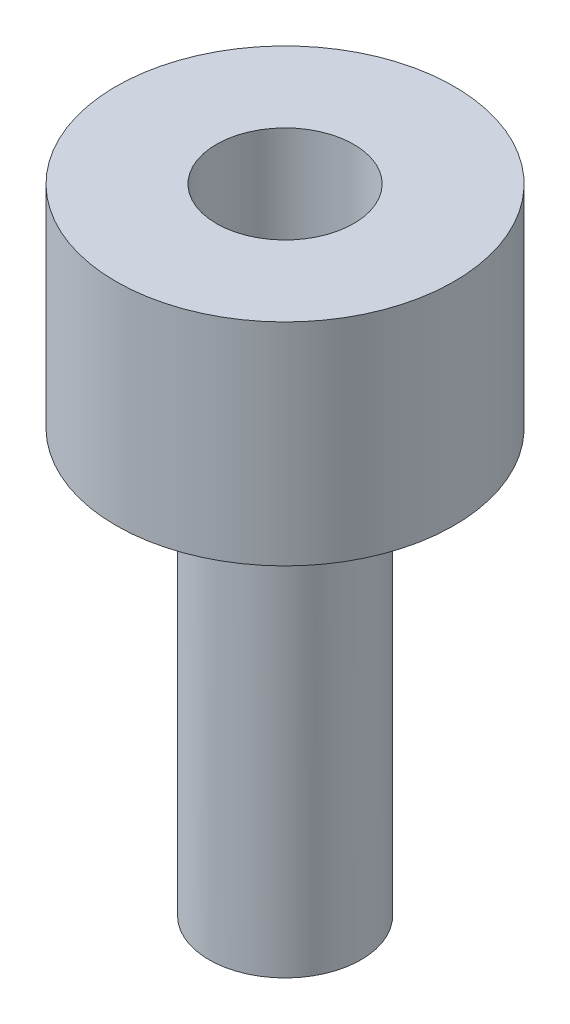
ISO-10303-21;
HEADER;
FILE_DESCRIPTION(('STEP AP214'),'2;1');
FILE_NAME('part.step','',(''),(''),'','','');
FILE_SCHEMA(('AUTOMOTIVE_DESIGN { 1 0 10303 214 1 1 1 1 }'));
ENDSEC;
DATA;
#1=APPLICATION_CONTEXT('core data for automotive mechanical design processes');
#2=APPLICATION_PROTOCOL_DEFINITION('international standard','automotive_design',2000,#1);
#3=PRODUCT_CONTEXT('',#1,'mechanical');
#4=PRODUCT('Part','Part','',(#3));
#5=PRODUCT_RELATED_PRODUCT_CATEGORY('part','',(#4));
#6=PRODUCT_DEFINITION_FORMATION('','',#4);
#7=PRODUCT_DEFINITION_CONTEXT('part definition',#1,'design');
#8=PRODUCT_DEFINITION('design','',#6,#7);
#9=PRODUCT_DEFINITION_SHAPE('','',#8);
#10=(LENGTH_UNIT() NAMED_UNIT(*) SI_UNIT(.MILLI.,.METRE.));
#11=(NAMED_UNIT(*) PLANE_ANGLE_UNIT() SI_UNIT($,.RADIAN.));
#12=(NAMED_UNIT(*) SI_UNIT($,.STERADIAN.) SOLID_ANGLE_UNIT());
#13=UNCERTAINTY_MEASURE_WITH_UNIT(LENGTH_MEASURE(1.E-05),#10,'distance_accuracy_value','');
#14=(GEOMETRIC_REPRESENTATION_CONTEXT(3) GLOBAL_UNCERTAINTY_ASSIGNED_CONTEXT((#13)) GLOBAL_UNIT_ASSIGNED_CONTEXT((#10,
#11,#12)) REPRESENTATION_CONTEXT('',''));
#15=CARTESIAN_POINT('',(0.,0.,0.));
#16=DIRECTION('',(0.,0.,1.));
#17=DIRECTION('',(1.,0.,0.));
#18=AXIS2_PLACEMENT_3D('',#15,#16,#17);
#19=CARTESIAN_POINT('',(0.,10.,0.));
#20=DIRECTION('',(0.,-1.,0.));
#21=DIRECTION('',(0.,0.,-1.));
#22=AXIS2_PLACEMENT_3D('',#19,#20,#21);
#23=CYLINDRICAL_SURFACE('',#22,3.6);
#24=CARTESIAN_POINT('',(0.,8.,0.));
#25=DIRECTION('',(0.,1.,0.));
#26=DIRECTION('',(0.,0.,1.));
#27=AXIS2_PLACEMENT_3D('',#24,#25,#26);
#28=CIRCLE('',#27,3.6);
#29=CARTESIAN_POINT('',(0.,8.,3.6));
#30=VERTEX_POINT('',#29);
#31=EDGE_CURVE('E10',#30,#30,#28,.F.);
#32=ORIENTED_EDGE('',*,*,#31,.T.);
#33=EDGE_LOOP('',(#32));
#34=FACE_BOUND('',#33,.T.);
#35=CARTESIAN_POINT('',(0.,-10.,0.));
#36=DIRECTION('',(0.,-1.,0.));
#37=DIRECTION('',(0.,0.,-1.));
#38=AXIS2_PLACEMENT_3D('',#35,#36,#37);
#39=CIRCLE('',#38,3.6);
#40=CARTESIAN_POINT('',(0.,-10.,-3.6));
#41=VERTEX_POINT('',#40);
#42=EDGE_CURVE('E66',#41,#41,#39,.T.);
#43=ORIENTED_EDGE('',*,*,#42,.F.);
#44=EDGE_LOOP('',(#43));
#45=FACE_BOUND('',#44,.T.);
#46=ADVANCED_FACE('F37',(#34,#45),#23,.T.);
#47=CARTESIAN_POINT('',(0.,20.,0.));
#48=DIRECTION('',(0.,-1.,0.));
#49=DIRECTION('',(0.,0.,-1.));
#50=AXIS2_PLACEMENT_3D('',#47,#48,#49);
#51=CYLINDRICAL_SURFACE('',#50,8.);
#52=CARTESIAN_POINT('',(0.,20.,0.));
#53=DIRECTION('',(0.,1.,0.));
#54=DIRECTION('',(0.,0.,1.));
#55=AXIS2_PLACEMENT_3D('',#52,#53,#54);
#56=CIRCLE('',#55,8.);
#57=CARTESIAN_POINT('',(0.,20.,8.));
#58=VERTEX_POINT('',#57);
#59=EDGE_CURVE('E50',#58,#58,#56,.T.);
#60=ORIENTED_EDGE('',*,*,#59,.F.);
#61=EDGE_LOOP('',(#60));
#62=FACE_BOUND('',#61,.T.);
#63=CARTESIAN_POINT('',(0.,10.,0.));
#64=DIRECTION('',(0.,1.,0.));
#65=DIRECTION('',(0.,0.,1.));
#66=AXIS2_PLACEMENT_3D('',#63,#64,#65);
#67=CIRCLE('',#66,8.);
#68=CARTESIAN_POINT('',(0.,10.,8.));
#69=VERTEX_POINT('',#68);
#70=EDGE_CURVE('E55',#69,#69,#67,.T.);
#71=ORIENTED_EDGE('',*,*,#70,.T.);
#72=EDGE_LOOP('',(#71));
#73=FACE_BOUND('',#72,.T.);
#74=ADVANCED_FACE('F77',(#62,#73),#51,.T.);
#75=CARTESIAN_POINT('',(0.,20.,0.));
#76=DIRECTION('',(0.,1.,0.));
#77=DIRECTION('',(0.,0.,1.));
#78=AXIS2_PLACEMENT_3D('',#75,#76,#77);
#79=PLANE('',#78);
#80=CARTESIAN_POINT('',(0.,20.,0.));
#81=DIRECTION('',(0.,1.,0.));
#82=DIRECTION('',(0.,0.,1.));
#83=AXIS2_PLACEMENT_3D('',#80,#81,#82);
#84=CIRCLE('',#83,3.25);
#85=CARTESIAN_POINT('',(0.,20.,3.25));
#86=VERTEX_POINT('',#85);
#87=EDGE_CURVE('E62',#86,#86,#84,.T.);
#88=ORIENTED_EDGE('',*,*,#87,.F.);
#89=EDGE_LOOP('',(#88));
#90=FACE_BOUND('',#89,.T.);
#91=ORIENTED_EDGE('',*,*,#59,.T.);
#92=EDGE_LOOP('',(#91));
#93=FACE_BOUND('',#92,.T.);
#94=ADVANCED_FACE('F81',(#90,#93),#79,.T.);
#95=CARTESIAN_POINT('',(0.,10.,0.));
#96=DIRECTION('',(0.,1.,0.));
#97=DIRECTION('',(0.,0.,1.));
#98=AXIS2_PLACEMENT_3D('',#95,#96,#97);
#99=PLANE('',#98);
#100=CARTESIAN_POINT('',(0.,10.,0.));
#101=DIRECTION('',(0.,1.,0.));
#102=DIRECTION('',(0.,0.,1.));
#103=AXIS2_PLACEMENT_3D('',#100,#101,#102);
#104=CIRCLE('',#103,5.6);
#105=CARTESIAN_POINT('',(0.,10.,5.6));
#106=VERTEX_POINT('',#105);
#107=EDGE_CURVE('E45',#106,#106,#104,.T.);
#108=ORIENTED_EDGE('',*,*,#107,.T.);
#109=EDGE_LOOP('',(#108));
#110=FACE_BOUND('',#109,.T.);
#111=ORIENTED_EDGE('',*,*,#70,.F.);
#112=EDGE_LOOP('',(#111));
#113=FACE_BOUND('',#112,.T.);
#114=ADVANCED_FACE('F85',(#110,#113),#99,.F.);
#115=CARTESIAN_POINT('',(0.,12.,0.));
#116=DIRECTION('',(0.,1.,0.));
#117=DIRECTION('',(0.,0.,1.));
#118=AXIS2_PLACEMENT_3D('',#115,#116,#117);
#119=CYLINDRICAL_SURFACE('',#118,3.25);
#120=CARTESIAN_POINT('',(0.,12.,0.));
#121=DIRECTION('',(0.,1.,0.));
#122=DIRECTION('',(0.,0.,1.));
#123=AXIS2_PLACEMENT_3D('',#120,#121,#122);
#124=CIRCLE('',#123,3.25);
#125=CARTESIAN_POINT('',(0.,12.,3.25));
#126=VERTEX_POINT('',#125);
#127=EDGE_CURVE('E60',#126,#126,#124,.T.);
#128=ORIENTED_EDGE('',*,*,#127,.F.);
#129=EDGE_LOOP('',(#128));
#130=FACE_BOUND('',#129,.T.);
#131=ORIENTED_EDGE('',*,*,#87,.T.);
#132=EDGE_LOOP('',(#131));
#133=FACE_BOUND('',#132,.T.);
#134=ADVANCED_FACE('F88',(#130,#133),#119,.F.);
#135=CARTESIAN_POINT('',(0.,12.,0.));
#136=DIRECTION('',(0.,1.,0.));
#137=DIRECTION('',(0.,0.,1.));
#138=AXIS2_PLACEMENT_3D('',#135,#136,#137);
#139=PLANE('',#138);
#140=ORIENTED_EDGE('',*,*,#127,.T.);
#141=EDGE_LOOP('',(#140));
#142=FACE_BOUND('',#141,.T.);
#143=ADVANCED_FACE('F94',(#142),#139,.T.);
#144=CARTESIAN_POINT('',(0.,-10.,0.));
#145=DIRECTION('',(0.,-1.,0.));
#146=DIRECTION('',(0.,0.,-1.));
#147=AXIS2_PLACEMENT_3D('',#144,#145,#146);
#148=PLANE('',#147);
#149=ORIENTED_EDGE('',*,*,#42,.T.);
#150=EDGE_LOOP('',(#149));
#151=FACE_BOUND('',#150,.T.);
#152=ADVANCED_FACE('F74',(#151),#148,.T.);
#153=CARTESIAN_POINT('',(0.,8.,0.));
#154=DIRECTION('',(0.,1.,0.));
#155=DIRECTION('',(0.,0.,1.));
#156=AXIS2_PLACEMENT_3D('',#153,#154,#155);
#157=TOROIDAL_SURFACE('',#156,5.6,2.);
#158=ORIENTED_EDGE('',*,*,#31,.F.);
#159=EDGE_LOOP('',(#158));
#160=FACE_BOUND('',#159,.T.);
#161=ORIENTED_EDGE('',*,*,#107,.F.);
#162=EDGE_LOOP('',(#161));
#163=FACE_BOUND('',#162,.T.);
#164=ADVANCED_FACE('F39',(#160,#163),#157,.F.);
#165=CLOSED_SHELL('',(#46,#74,#94,#114,#134,#143,#152,#164));
#166=MANIFOLD_SOLID_BREP('B2',#165);
#167=ADVANCED_BREP_SHAPE_REPRESENTATION('',(#18,#166),#14);
#168=SHAPE_DEFINITION_REPRESENTATION(#9,#167);
ENDSEC;
END-ISO-10303-21;
